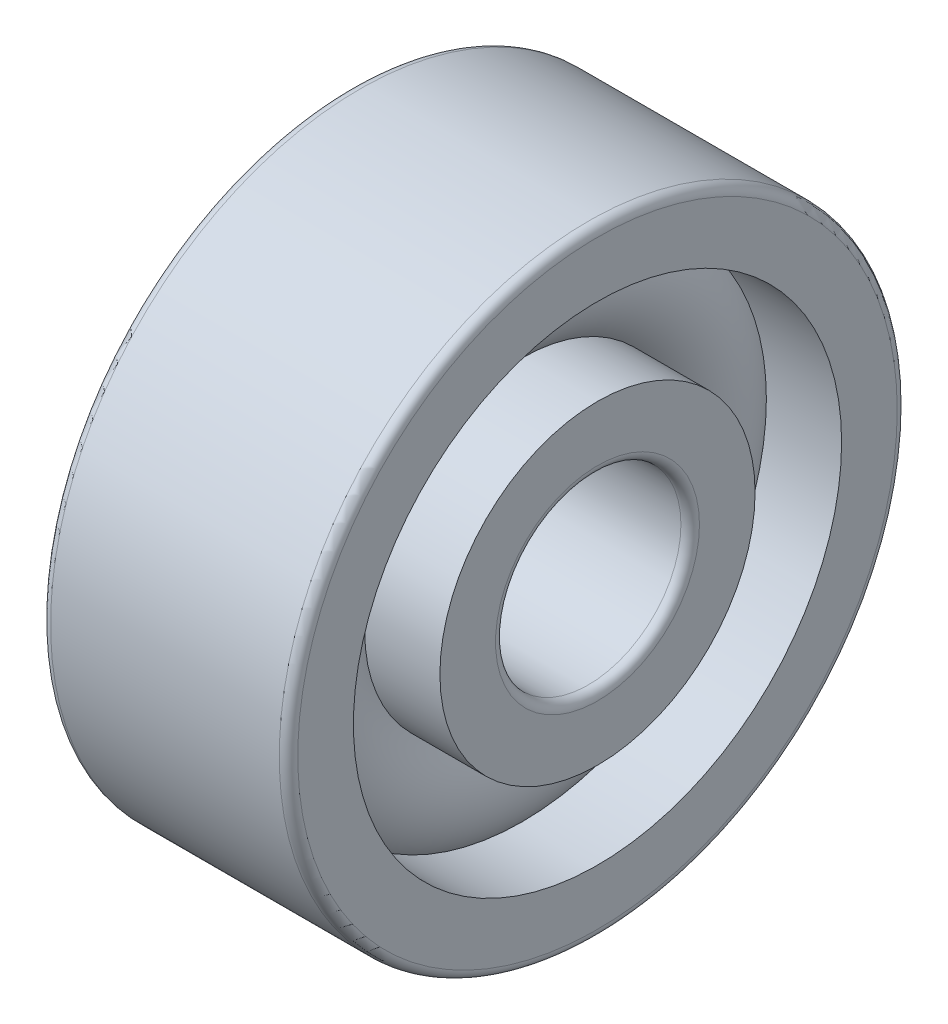
ISO-10303-21;
HEADER;
FILE_DESCRIPTION(('STEP AP214'),'2;1');
FILE_NAME('part.step','',(''),(''),'','','');
FILE_SCHEMA(('AUTOMOTIVE_DESIGN { 1 0 10303 214 1 1 1 1 }'));
ENDSEC;
DATA;
#1=APPLICATION_CONTEXT('core data for automotive mechanical design processes');
#2=APPLICATION_PROTOCOL_DEFINITION('international standard','automotive_design',2000,#1);
#3=PRODUCT_CONTEXT('',#1,'mechanical');
#4=PRODUCT('Part','Part','',(#3));
#5=PRODUCT_RELATED_PRODUCT_CATEGORY('part','',(#4));
#6=PRODUCT_DEFINITION_FORMATION('','',#4);
#7=PRODUCT_DEFINITION_CONTEXT('part definition',#1,'design');
#8=PRODUCT_DEFINITION('design','',#6,#7);
#9=PRODUCT_DEFINITION_SHAPE('','',#8);
#10=(LENGTH_UNIT() NAMED_UNIT(*) SI_UNIT(.MILLI.,.METRE.));
#11=(NAMED_UNIT(*) PLANE_ANGLE_UNIT() SI_UNIT($,.RADIAN.));
#12=(NAMED_UNIT(*) SI_UNIT($,.STERADIAN.) SOLID_ANGLE_UNIT());
#13=UNCERTAINTY_MEASURE_WITH_UNIT(LENGTH_MEASURE(1.E-05),#10,'distance_accuracy_value','');
#14=(GEOMETRIC_REPRESENTATION_CONTEXT(3) GLOBAL_UNCERTAINTY_ASSIGNED_CONTEXT((#13)) GLOBAL_UNIT_ASSIGNED_CONTEXT((#10,
#11,#12)) REPRESENTATION_CONTEXT('',''));
#15=CARTESIAN_POINT('',(0.,0.,0.));
#16=DIRECTION('',(0.,0.,1.));
#17=DIRECTION('',(1.,0.,0.));
#18=AXIS2_PLACEMENT_3D('',#15,#16,#17);
#19=CARTESIAN_POINT('',(0.,0.,0.));
#20=DIRECTION('',(-1.,0.,0.));
#21=DIRECTION('',(0.,0.,1.));
#22=AXIS2_PLACEMENT_3D('',#19,#20,#21);
#23=TOROIDAL_SURFACE('',#22,3.25,1.05);
#24=CARTESIAN_POINT('',(0.782623792124921,0.,0.));
#25=DIRECTION('',(-1.,0.,0.));
#26=DIRECTION('',(0.,0.,1.));
#27=AXIS2_PLACEMENT_3D('',#24,#25,#26);
#28=CIRCLE('',#27,3.95);
#29=CARTESIAN_POINT('',(0.782623792124921,0.,3.95));
#30=VERTEX_POINT('',#29);
#31=EDGE_CURVE('E18',#30,#30,#28,.F.);
#32=ORIENTED_EDGE('',*,*,#31,.T.);
#33=EDGE_LOOP('',(#32));
#34=FACE_BOUND('',#33,.T.);
#35=CARTESIAN_POINT('',(0.782623792124927,0.,0.));
#36=DIRECTION('',(-1.,0.,0.));
#37=DIRECTION('',(0.,0.,1.));
#38=AXIS2_PLACEMENT_3D('',#35,#36,#37);
#39=CIRCLE('',#38,2.55);
#40=CARTESIAN_POINT('',(0.782623792124927,0.,2.55));
#41=VERTEX_POINT('',#40);
#42=EDGE_CURVE('E10',#41,#41,#39,.T.);
#43=ORIENTED_EDGE('',*,*,#42,.T.);
#44=EDGE_LOOP('',(#43));
#45=FACE_BOUND('',#44,.T.);
#46=ADVANCED_FACE('F14',(#34,#45),#23,.T.);
#47=CARTESIAN_POINT('',(-20.6375,0.,0.));
#48=DIRECTION('',(1.,0.,0.));
#49=DIRECTION('',(0.,0.,-1.));
#50=AXIS2_PLACEMENT_3D('',#47,#48,#49);
#51=CYLINDRICAL_SURFACE('',#50,2.55);
#52=CARTESIAN_POINT('',(2.,0.,0.));
#53=DIRECTION('',(1.,0.,0.));
#54=DIRECTION('',(0.,0.,-1.));
#55=AXIS2_PLACEMENT_3D('',#52,#53,#54);
#56=CIRCLE('',#55,2.55);
#57=CARTESIAN_POINT('',(2.,0.,-2.55));
#58=VERTEX_POINT('',#57);
#59=EDGE_CURVE('E27',#58,#58,#56,.T.);
#60=ORIENTED_EDGE('',*,*,#59,.F.);
#61=EDGE_LOOP('',(#60));
#62=FACE_BOUND('',#61,.T.);
#63=ORIENTED_EDGE('',*,*,#42,.F.);
#64=EDGE_LOOP('',(#63));
#65=FACE_BOUND('',#64,.T.);
#66=ADVANCED_FACE('F66',(#62,#65),#51,.T.);
#67=CARTESIAN_POINT('',(-20.6375,0.,0.));
#68=DIRECTION('',(1.,0.,0.));
#69=DIRECTION('',(0.,0.,-1.));
#70=AXIS2_PLACEMENT_3D('',#67,#68,#69);
#71=CYLINDRICAL_SURFACE('',#70,2.55);
#72=CARTESIAN_POINT('',(-2.,0.,0.));
#73=DIRECTION('',(1.,0.,0.));
#74=DIRECTION('',(0.,0.,-1.));
#75=AXIS2_PLACEMENT_3D('',#72,#73,#74);
#76=CIRCLE('',#75,2.55);
#77=CARTESIAN_POINT('',(-2.,0.,-2.55));
#78=VERTEX_POINT('',#77);
#79=EDGE_CURVE('E36',#78,#78,#76,.T.);
#80=ORIENTED_EDGE('',*,*,#79,.T.);
#81=EDGE_LOOP('',(#80));
#82=FACE_BOUND('',#81,.T.);
#83=CARTESIAN_POINT('',(-0.782623792124927,0.,0.));
#84=DIRECTION('',(1.,0.,0.));
#85=DIRECTION('',(0.,0.,-1.));
#86=AXIS2_PLACEMENT_3D('',#83,#84,#85);
#87=CIRCLE('',#86,2.55);
#88=CARTESIAN_POINT('',(-0.782623792124927,0.,-2.55));
#89=VERTEX_POINT('',#88);
#90=EDGE_CURVE('E22',#89,#89,#87,.T.);
#91=ORIENTED_EDGE('',*,*,#90,.F.);
#92=EDGE_LOOP('',(#91));
#93=FACE_BOUND('',#92,.T.);
#94=ADVANCED_FACE('F69',(#82,#93),#71,.T.);
#95=CARTESIAN_POINT('',(2.,1.65,0.));
#96=DIRECTION('',(1.,0.,0.));
#97=DIRECTION('',(0.,0.,-1.));
#98=AXIS2_PLACEMENT_3D('',#95,#96,#97);
#99=PLANE('',#98);
#100=ORIENTED_EDGE('',*,*,#59,.T.);
#101=EDGE_LOOP('',(#100));
#102=FACE_BOUND('',#101,.T.);
#103=CARTESIAN_POINT('',(2.,0.,0.));
#104=DIRECTION('',(1.,0.,0.));
#105=DIRECTION('',(0.,0.,-1.));
#106=AXIS2_PLACEMENT_3D('',#103,#104,#105);
#107=CIRCLE('',#106,1.65);
#108=CARTESIAN_POINT('',(2.,0.,-1.65));
#109=VERTEX_POINT('',#108);
#110=EDGE_CURVE('E58',#109,#109,#107,.T.);
#111=ORIENTED_EDGE('',*,*,#110,.F.);
#112=EDGE_LOOP('',(#111));
#113=FACE_BOUND('',#112,.T.);
#114=ADVANCED_FACE('F63',(#102,#113),#99,.T.);
#115=CARTESIAN_POINT('',(1.85,0.,0.));
#116=DIRECTION('',(1.,0.,0.));
#117=DIRECTION('',(0.,0.,-1.));
#118=AXIS2_PLACEMENT_3D('',#115,#116,#117);
#119=TOROIDAL_SURFACE('',#118,1.65,0.15);
#120=ORIENTED_EDGE('',*,*,#110,.T.);
#121=EDGE_LOOP('',(#120));
#122=FACE_BOUND('',#121,.T.);
#123=CARTESIAN_POINT('',(1.85,0.,0.));
#124=DIRECTION('',(1.,0.,0.));
#125=DIRECTION('',(0.,0.,-1.));
#126=AXIS2_PLACEMENT_3D('',#123,#124,#125);
#127=CIRCLE('',#126,1.5);
#128=CARTESIAN_POINT('',(1.85,0.,-1.5));
#129=VERTEX_POINT('',#128);
#130=EDGE_CURVE('E55',#129,#129,#127,.T.);
#131=ORIENTED_EDGE('',*,*,#130,.F.);
#132=EDGE_LOOP('',(#131));
#133=FACE_BOUND('',#132,.T.);
#134=ADVANCED_FACE('F81',(#122,#133),#119,.T.);
#135=CARTESIAN_POINT('',(-20.6375,0.,0.));
#136=DIRECTION('',(1.,0.,0.));
#137=DIRECTION('',(0.,0.,-1.));
#138=AXIS2_PLACEMENT_3D('',#135,#136,#137);
#139=CYLINDRICAL_SURFACE('',#138,1.5);
#140=ORIENTED_EDGE('',*,*,#130,.T.);
#141=EDGE_LOOP('',(#140));
#142=FACE_BOUND('',#141,.T.);
#143=CARTESIAN_POINT('',(-1.85,0.,0.));
#144=DIRECTION('',(1.,0.,0.));
#145=DIRECTION('',(0.,0.,-1.));
#146=AXIS2_PLACEMENT_3D('',#143,#144,#145);
#147=CIRCLE('',#146,1.5);
#148=CARTESIAN_POINT('',(-1.85,0.,-1.5));
#149=VERTEX_POINT('',#148);
#150=EDGE_CURVE('E52',#149,#149,#147,.T.);
#151=ORIENTED_EDGE('',*,*,#150,.F.);
#152=EDGE_LOOP('',(#151));
#153=FACE_BOUND('',#152,.T.);
#154=ADVANCED_FACE('F84',(#142,#153),#139,.F.);
#155=CARTESIAN_POINT('',(-1.85,0.,0.));
#156=DIRECTION('',(1.,0.,0.));
#157=DIRECTION('',(0.,0.,-1.));
#158=AXIS2_PLACEMENT_3D('',#155,#156,#157);
#159=TOROIDAL_SURFACE('',#158,1.65,0.15);
#160=ORIENTED_EDGE('',*,*,#150,.T.);
#161=EDGE_LOOP('',(#160));
#162=FACE_BOUND('',#161,.T.);
#163=CARTESIAN_POINT('',(-2.,0.,0.));
#164=DIRECTION('',(1.,0.,0.));
#165=DIRECTION('',(0.,0.,-1.));
#166=AXIS2_PLACEMENT_3D('',#163,#164,#165);
#167=CIRCLE('',#166,1.65);
#168=CARTESIAN_POINT('',(-2.,0.,-1.65));
#169=VERTEX_POINT('',#168);
#170=EDGE_CURVE('E49',#169,#169,#167,.T.);
#171=ORIENTED_EDGE('',*,*,#170,.F.);
#172=EDGE_LOOP('',(#171));
#173=FACE_BOUND('',#172,.T.);
#174=ADVANCED_FACE('F88',(#162,#173),#159,.T.);
#175=CARTESIAN_POINT('',(-2.,2.55,0.));
#176=DIRECTION('',(-1.,0.,0.));
#177=DIRECTION('',(0.,0.,1.));
#178=AXIS2_PLACEMENT_3D('',#175,#176,#177);
#179=PLANE('',#178);
#180=ORIENTED_EDGE('',*,*,#170,.T.);
#181=EDGE_LOOP('',(#180));
#182=FACE_BOUND('',#181,.T.);
#183=ORIENTED_EDGE('',*,*,#79,.F.);
#184=EDGE_LOOP('',(#183));
#185=FACE_BOUND('',#184,.T.);
#186=ADVANCED_FACE('F92',(#182,#185),#179,.T.);
#187=CARTESIAN_POINT('',(-0.782623792124921,0.,0.));
#188=DIRECTION('',(1.,0.,0.));
#189=DIRECTION('',(0.,0.,-1.));
#190=AXIS2_PLACEMENT_3D('',#187,#188,#189);
#191=CIRCLE('',#190,3.95);
#192=CARTESIAN_POINT('',(-0.782623792124921,0.,-3.95));
#193=VERTEX_POINT('',#192);
#194=EDGE_CURVE('E30',#193,#193,#191,.F.);
#195=ORIENTED_EDGE('',*,*,#194,.T.);
#196=EDGE_LOOP('',(#195));
#197=FACE_BOUND('',#196,.T.);
#198=ORIENTED_EDGE('',*,*,#90,.T.);
#199=EDGE_LOOP('',(#198));
#200=FACE_BOUND('',#199,.T.);
#201=ADVANCED_FACE('F16',(#197,#200),#23,.T.);
#202=CARTESIAN_POINT('',(-20.6375,0.,0.));
#203=DIRECTION('',(1.,0.,0.));
#204=DIRECTION('',(0.,0.,-1.));
#205=AXIS2_PLACEMENT_3D('',#202,#203,#204);
#206=CYLINDRICAL_SURFACE('',#205,3.95);
#207=CARTESIAN_POINT('',(2.,0.,0.));
#208=DIRECTION('',(1.,0.,0.));
#209=DIRECTION('',(0.,0.,-1.));
#210=AXIS2_PLACEMENT_3D('',#207,#208,#209);
#211=CIRCLE('',#210,3.95);
#212=CARTESIAN_POINT('',(2.,0.,-3.95));
#213=VERTEX_POINT('',#212);
#214=EDGE_CURVE('E32',#213,#213,#211,.T.);
#215=ORIENTED_EDGE('',*,*,#214,.T.);
#216=EDGE_LOOP('',(#215));
#217=FACE_BOUND('',#216,.T.);
#218=ORIENTED_EDGE('',*,*,#31,.F.);
#219=EDGE_LOOP('',(#218));
#220=FACE_BOUND('',#219,.T.);
#221=ADVANCED_FACE('F97',(#217,#220),#206,.F.);
#222=CARTESIAN_POINT('',(-20.6375,0.,0.));
#223=DIRECTION('',(1.,0.,0.));
#224=DIRECTION('',(0.,0.,-1.));
#225=AXIS2_PLACEMENT_3D('',#222,#223,#224);
#226=CYLINDRICAL_SURFACE('',#225,3.95);
#227=CARTESIAN_POINT('',(-2.,0.,0.));
#228=DIRECTION('',(1.,0.,0.));
#229=DIRECTION('',(0.,0.,-1.));
#230=AXIS2_PLACEMENT_3D('',#227,#228,#229);
#231=CIRCLE('',#230,3.95);
#232=CARTESIAN_POINT('',(-2.,0.,-3.95));
#233=VERTEX_POINT('',#232);
#234=EDGE_CURVE('E128',#233,#233,#231,.T.);
#235=ORIENTED_EDGE('',*,*,#234,.F.);
#236=EDGE_LOOP('',(#235));
#237=FACE_BOUND('',#236,.T.);
#238=ORIENTED_EDGE('',*,*,#194,.F.);
#239=EDGE_LOOP('',(#238));
#240=FACE_BOUND('',#239,.T.);
#241=ADVANCED_FACE('F100',(#237,#240),#226,.F.);
#242=CARTESIAN_POINT('',(2.,4.85,0.));
#243=DIRECTION('',(1.,0.,0.));
#244=DIRECTION('',(0.,0.,-1.));
#245=AXIS2_PLACEMENT_3D('',#242,#243,#244);
#246=PLANE('',#245);
#247=CARTESIAN_POINT('',(2.,0.,0.));
#248=DIRECTION('',(1.,0.,0.));
#249=DIRECTION('',(0.,0.,-1.));
#250=AXIS2_PLACEMENT_3D('',#247,#248,#249);
#251=CIRCLE('',#250,4.85);
#252=CARTESIAN_POINT('',(2.,0.,-4.85));
#253=VERTEX_POINT('',#252);
#254=EDGE_CURVE('E38',#253,#253,#251,.T.);
#255=ORIENTED_EDGE('',*,*,#254,.T.);
#256=EDGE_LOOP('',(#255));
#257=FACE_BOUND('',#256,.T.);
#258=ORIENTED_EDGE('',*,*,#214,.F.);
#259=EDGE_LOOP('',(#258));
#260=FACE_BOUND('',#259,.T.);
#261=ADVANCED_FACE('F101',(#257,#260),#246,.T.);
#262=CARTESIAN_POINT('',(1.85,0.,0.));
#263=DIRECTION('',(1.,0.,0.));
#264=DIRECTION('',(0.,0.,-1.));
#265=AXIS2_PLACEMENT_3D('',#262,#263,#264);
#266=TOROIDAL_SURFACE('',#265,4.85,0.15);
#267=CARTESIAN_POINT('',(1.85,0.,0.));
#268=DIRECTION('',(1.,0.,0.));
#269=DIRECTION('',(0.,0.,-1.));
#270=AXIS2_PLACEMENT_3D('',#267,#268,#269);
#271=CIRCLE('',#270,5.);
#272=CARTESIAN_POINT('',(1.85,0.,-5.));
#273=VERTEX_POINT('',#272);
#274=EDGE_CURVE('E43',#273,#273,#271,.T.);
#275=ORIENTED_EDGE('',*,*,#274,.T.);
#276=EDGE_LOOP('',(#275));
#277=FACE_BOUND('',#276,.T.);
#278=ORIENTED_EDGE('',*,*,#254,.F.);
#279=EDGE_LOOP('',(#278));
#280=FACE_BOUND('',#279,.T.);
#281=ADVANCED_FACE('F104',(#277,#280),#266,.T.);
#282=CARTESIAN_POINT('',(-20.6375,0.,0.));
#283=DIRECTION('',(1.,0.,0.));
#284=DIRECTION('',(0.,0.,-1.));
#285=AXIS2_PLACEMENT_3D('',#282,#283,#284);
#286=CYLINDRICAL_SURFACE('',#285,5.);
#287=CARTESIAN_POINT('',(-1.85,0.,0.));
#288=DIRECTION('',(1.,0.,0.));
#289=DIRECTION('',(0.,0.,-1.));
#290=AXIS2_PLACEMENT_3D('',#287,#288,#289);
#291=CIRCLE('',#290,5.);
#292=CARTESIAN_POINT('',(-1.85,0.,-5.));
#293=VERTEX_POINT('',#292);
#294=EDGE_CURVE('E132',#293,#293,#291,.T.);
#295=ORIENTED_EDGE('',*,*,#294,.T.);
#296=EDGE_LOOP('',(#295));
#297=FACE_BOUND('',#296,.T.);
#298=ORIENTED_EDGE('',*,*,#274,.F.);
#299=EDGE_LOOP('',(#298));
#300=FACE_BOUND('',#299,.T.);
#301=ADVANCED_FACE('F108',(#297,#300),#286,.T.);
#302=CARTESIAN_POINT('',(-1.85,0.,0.));
#303=DIRECTION('',(1.,0.,0.));
#304=DIRECTION('',(0.,0.,-1.));
#305=AXIS2_PLACEMENT_3D('',#302,#303,#304);
#306=TOROIDAL_SURFACE('',#305,4.85,0.15);
#307=CARTESIAN_POINT('',(-2.,0.,0.));
#308=DIRECTION('',(1.,0.,0.));
#309=DIRECTION('',(0.,0.,-1.));
#310=AXIS2_PLACEMENT_3D('',#307,#308,#309);
#311=CIRCLE('',#310,4.85);
#312=CARTESIAN_POINT('',(-2.,0.,-4.85));
#313=VERTEX_POINT('',#312);
#314=EDGE_CURVE('E129',#313,#313,#311,.T.);
#315=ORIENTED_EDGE('',*,*,#314,.T.);
#316=EDGE_LOOP('',(#315));
#317=FACE_BOUND('',#316,.T.);
#318=ORIENTED_EDGE('',*,*,#294,.F.);
#319=EDGE_LOOP('',(#318));
#320=FACE_BOUND('',#319,.T.);
#321=ADVANCED_FACE('F112',(#317,#320),#306,.T.);
#322=CARTESIAN_POINT('',(-2.,3.95,0.));
#323=DIRECTION('',(-1.,0.,0.));
#324=DIRECTION('',(0.,0.,1.));
#325=AXIS2_PLACEMENT_3D('',#322,#323,#324);
#326=PLANE('',#325);
#327=ORIENTED_EDGE('',*,*,#234,.T.);
#328=EDGE_LOOP('',(#327));
#329=FACE_BOUND('',#328,.T.);
#330=ORIENTED_EDGE('',*,*,#314,.F.);
#331=EDGE_LOOP('',(#330));
#332=FACE_BOUND('',#331,.T.);
#333=ADVANCED_FACE('F116',(#329,#332),#326,.T.);
#334=CLOSED_SHELL('',(#46,#66,#94,#114,#134,#154,#174,#186,#201,#221,#241,#261,#281,#301,#321,#333));
#335=MANIFOLD_SOLID_BREP('B1',#334);
#336=ADVANCED_BREP_SHAPE_REPRESENTATION('',(#18,#335),#14);
#337=SHAPE_DEFINITION_REPRESENTATION(#9,#336);
ENDSEC;
END-ISO-10303-21;
